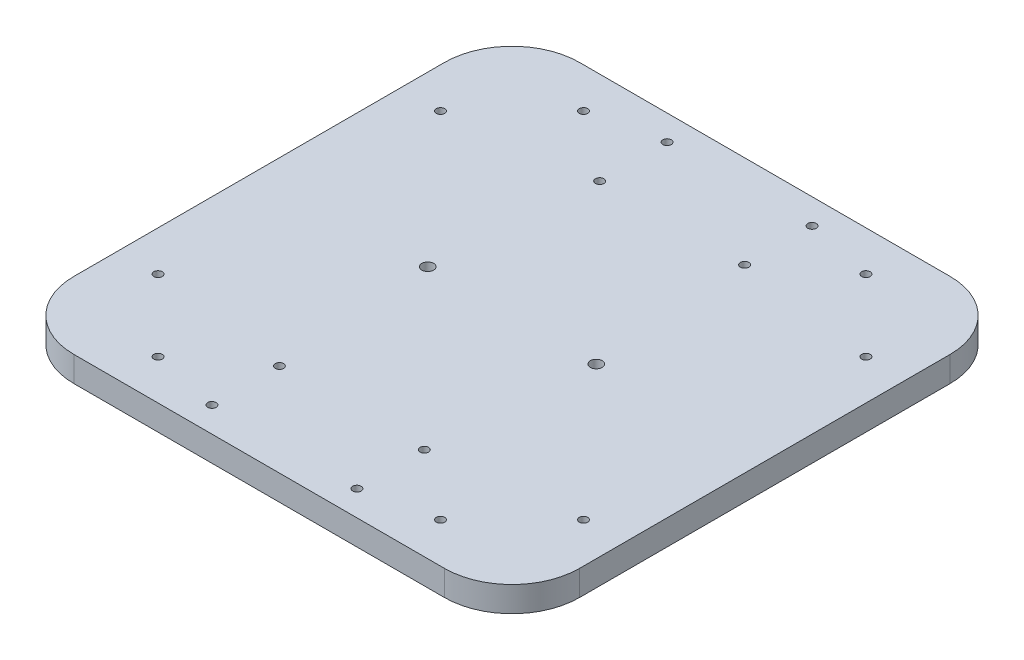
ISO-10303-21;
HEADER;
FILE_DESCRIPTION(('STEP AP214'),'2;1');
FILE_NAME('part.step','',(''),(''),'','','');
FILE_SCHEMA(('AUTOMOTIVE_DESIGN { 1 0 10303 214 1 1 1 1 }'));
ENDSEC;
DATA;
#1=APPLICATION_CONTEXT('core data for automotive mechanical design processes');
#2=APPLICATION_PROTOCOL_DEFINITION('international standard','automotive_design',2000,#1);
#3=PRODUCT_CONTEXT('',#1,'mechanical');
#4=PRODUCT('Part','Part','',(#3));
#5=PRODUCT_RELATED_PRODUCT_CATEGORY('part','',(#4));
#6=PRODUCT_DEFINITION_FORMATION('','',#4);
#7=PRODUCT_DEFINITION_CONTEXT('part definition',#1,'design');
#8=PRODUCT_DEFINITION('design','',#6,#7);
#9=PRODUCT_DEFINITION_SHAPE('','',#8);
#10=(LENGTH_UNIT() NAMED_UNIT(*) SI_UNIT(.MILLI.,.METRE.));
#11=(NAMED_UNIT(*) PLANE_ANGLE_UNIT() SI_UNIT($,.RADIAN.));
#12=(NAMED_UNIT(*) SI_UNIT($,.STERADIAN.) SOLID_ANGLE_UNIT());
#13=UNCERTAINTY_MEASURE_WITH_UNIT(LENGTH_MEASURE(1.E-05),#10,'distance_accuracy_value','');
#14=(GEOMETRIC_REPRESENTATION_CONTEXT(3) GLOBAL_UNCERTAINTY_ASSIGNED_CONTEXT((#13)) GLOBAL_UNIT_ASSIGNED_CONTEXT((#10,
#11,#12)) REPRESENTATION_CONTEXT('',''));
#15=CARTESIAN_POINT('',(0.,0.,0.));
#16=DIRECTION('',(0.,0.,1.));
#17=DIRECTION('',(1.,0.,0.));
#18=AXIS2_PLACEMENT_3D('',#15,#16,#17);
#19=CARTESIAN_POINT('',(150.,-7.5,150.));
#20=DIRECTION('',(-1.,0.,0.));
#21=DIRECTION('',(0.,0.,1.));
#22=AXIS2_PLACEMENT_3D('',#19,#20,#21);
#23=PLANE('',#22);
#24=DIRECTION('',(0.,0.,-1.));
#25=VECTOR('',#24,1.);
#26=CARTESIAN_POINT('',(150.,-7.5,150.));
#27=LINE('',#26,#25);
#28=CARTESIAN_POINT('',(150.,-7.5,110.));
#29=VERTEX_POINT('',#28);
#30=CARTESIAN_POINT('',(150.,-7.5,-110.));
#31=VERTEX_POINT('',#30);
#32=EDGE_CURVE('E124',#29,#31,#27,.T.);
#33=ORIENTED_EDGE('',*,*,#32,.T.);
#34=DIRECTION('',(0.,1.,0.));
#35=VECTOR('',#34,1.);
#36=CARTESIAN_POINT('',(150.,7.5,-110.));
#37=LINE('',#36,#35);
#38=CARTESIAN_POINT('',(150.,7.5,-110.));
#39=VERTEX_POINT('',#38);
#40=EDGE_CURVE('E152',#31,#39,#37,.T.);
#41=ORIENTED_EDGE('',*,*,#40,.T.);
#42=DIRECTION('',(0.,0.,-1.));
#43=VECTOR('',#42,1.);
#44=CARTESIAN_POINT('',(150.,7.5,150.));
#45=LINE('',#44,#43);
#46=CARTESIAN_POINT('',(150.,7.5,110.));
#47=VERTEX_POINT('',#46);
#48=EDGE_CURVE('E128',#47,#39,#45,.T.);
#49=ORIENTED_EDGE('',*,*,#48,.F.);
#50=DIRECTION('',(0.,1.,0.));
#51=VECTOR('',#50,1.);
#52=CARTESIAN_POINT('',(150.,-7.5,110.));
#53=LINE('',#52,#51);
#54=EDGE_CURVE('E150',#47,#29,#53,.F.);
#55=ORIENTED_EDGE('',*,*,#54,.T.);
#56=EDGE_LOOP('',(#33,#41,#49,#55));
#57=FACE_BOUND('',#56,.T.);
#58=ADVANCED_FACE('F36',(#57),#23,.F.);
#59=CARTESIAN_POINT('',(-150.,7.5,150.));
#60=DIRECTION('',(0.,-1.,0.));
#61=DIRECTION('',(0.,0.,-1.));
#62=AXIS2_PLACEMENT_3D('',#59,#60,#61);
#63=PLANE('',#62);
#64=CARTESIAN_POINT('',(43.,7.5,-95.));
#65=DIRECTION('',(0.,-1.,0.));
#66=DIRECTION('',(0.,0.,-1.));
#67=AXIS2_PLACEMENT_3D('',#64,#65,#66);
#68=CIRCLE('',#67,2.5);
#69=CARTESIAN_POINT('',(43.,7.5,-97.5));
#70=VERTEX_POINT('',#69);
#71=EDGE_CURVE('E253',#70,#70,#68,.T.);
#72=ORIENTED_EDGE('',*,*,#71,.T.);
#73=EDGE_LOOP('',(#72));
#74=FACE_BOUND('',#73,.T.);
#75=CARTESIAN_POINT('',(-43.,7.5,95.));
#76=DIRECTION('',(0.,-1.,0.));
#77=DIRECTION('',(0.,0.,-1.));
#78=AXIS2_PLACEMENT_3D('',#75,#76,#77);
#79=CIRCLE('',#78,2.5);
#80=CARTESIAN_POINT('',(-43.,7.5,92.5));
#81=VERTEX_POINT('',#80);
#82=EDGE_CURVE('E242',#81,#81,#79,.T.);
#83=ORIENTED_EDGE('',*,*,#82,.T.);
#84=EDGE_LOOP('',(#83));
#85=FACE_BOUND('',#84,.T.);
#86=CARTESIAN_POINT('',(43.,7.5,95.));
#87=DIRECTION('',(0.,-1.,0.));
#88=DIRECTION('',(0.,0.,-1.));
#89=AXIS2_PLACEMENT_3D('',#86,#87,#88);
#90=CIRCLE('',#89,2.5);
#91=CARTESIAN_POINT('',(43.,7.5,92.5));
#92=VERTEX_POINT('',#91);
#93=EDGE_CURVE('E241',#92,#92,#90,.T.);
#94=ORIENTED_EDGE('',*,*,#93,.T.);
#95=EDGE_LOOP('',(#94));
#96=FACE_BOUND('',#95,.T.);
#97=CARTESIAN_POINT('',(43.,7.5,135.));
#98=DIRECTION('',(0.,-1.,0.));
#99=DIRECTION('',(0.,0.,-1.));
#100=AXIS2_PLACEMENT_3D('',#97,#98,#99);
#101=CIRCLE('',#100,2.5);
#102=CARTESIAN_POINT('',(43.,7.5,132.5));
#103=VERTEX_POINT('',#102);
#104=EDGE_CURVE('E235',#103,#103,#101,.T.);
#105=ORIENTED_EDGE('',*,*,#104,.T.);
#106=EDGE_LOOP('',(#105));
#107=FACE_BOUND('',#106,.T.);
#108=CARTESIAN_POINT('',(43.,7.5,-135.));
#109=DIRECTION('',(0.,-1.,0.));
#110=DIRECTION('',(0.,0.,-1.));
#111=AXIS2_PLACEMENT_3D('',#108,#109,#110);
#112=CIRCLE('',#111,2.5);
#113=CARTESIAN_POINT('',(43.,7.5,-137.5));
#114=VERTEX_POINT('',#113);
#115=EDGE_CURVE('E254',#114,#114,#112,.T.);
#116=ORIENTED_EDGE('',*,*,#115,.T.);
#117=EDGE_LOOP('',(#116));
#118=FACE_BOUND('',#117,.T.);
#119=CARTESIAN_POINT('',(-43.,7.5,-135.));
#120=DIRECTION('',(0.,-1.,0.));
#121=DIRECTION('',(0.,0.,-1.));
#122=AXIS2_PLACEMENT_3D('',#119,#120,#121);
#123=CIRCLE('',#122,2.5);
#124=CARTESIAN_POINT('',(-43.,7.5,-137.5));
#125=VERTEX_POINT('',#124);
#126=EDGE_CURVE('E271',#125,#125,#123,.T.);
#127=ORIENTED_EDGE('',*,*,#126,.T.);
#128=EDGE_LOOP('',(#127));
#129=FACE_BOUND('',#128,.T.);
#130=CARTESIAN_POINT('',(-43.,7.5,-95.));
#131=DIRECTION('',(0.,-1.,0.));
#132=DIRECTION('',(0.,0.,-1.));
#133=AXIS2_PLACEMENT_3D('',#130,#131,#132);
#134=CIRCLE('',#133,2.5);
#135=CARTESIAN_POINT('',(-43.,7.5,-97.5));
#136=VERTEX_POINT('',#135);
#137=EDGE_CURVE('E265',#136,#136,#134,.T.);
#138=ORIENTED_EDGE('',*,*,#137,.T.);
#139=EDGE_LOOP('',(#138));
#140=FACE_BOUND('',#139,.T.);
#141=CARTESIAN_POINT('',(-43.,7.5,135.));
#142=DIRECTION('',(0.,-1.,0.));
#143=DIRECTION('',(0.,0.,-1.));
#144=AXIS2_PLACEMENT_3D('',#141,#142,#143);
#145=CIRCLE('',#144,2.5);
#146=CARTESIAN_POINT('',(-43.,7.5,132.5));
#147=VERTEX_POINT('',#146);
#148=EDGE_CURVE('E218',#147,#147,#145,.T.);
#149=ORIENTED_EDGE('',*,*,#148,.T.);
#150=EDGE_LOOP('',(#149));
#151=FACE_BOUND('',#150,.T.);
#152=CARTESIAN_POINT('',(-83.7867965644036,7.5,126.213203435596));
#153=DIRECTION('',(0.,-1.,0.));
#154=DIRECTION('',(0.,0.,-1.));
#155=AXIS2_PLACEMENT_3D('',#152,#153,#154);
#156=CIRCLE('',#155,2.5);
#157=CARTESIAN_POINT('',(-83.7867965644036,7.5,123.713203435596));
#158=VERTEX_POINT('',#157);
#159=EDGE_CURVE('E187',#158,#158,#156,.T.);
#160=ORIENTED_EDGE('',*,*,#159,.T.);
#161=EDGE_LOOP('',(#160));
#162=FACE_BOUND('',#161,.T.);
#163=CARTESIAN_POINT('',(83.7867965644035,7.5,126.213203435596));
#164=DIRECTION('',(0.,-1.,0.));
#165=DIRECTION('',(0.,0.,-1.));
#166=AXIS2_PLACEMENT_3D('',#163,#164,#165);
#167=CIRCLE('',#166,2.49999999999998);
#168=CARTESIAN_POINT('',(83.7867965644035,7.5,123.713203435596));
#169=VERTEX_POINT('',#168);
#170=EDGE_CURVE('E206',#169,#169,#167,.T.);
#171=ORIENTED_EDGE('',*,*,#170,.T.);
#172=EDGE_LOOP('',(#171));
#173=FACE_BOUND('',#172,.T.);
#174=CARTESIAN_POINT('',(126.213203435596,7.5,83.7867965644036));
#175=DIRECTION('',(0.,-1.,0.));
#176=DIRECTION('',(0.,0.,-1.));
#177=AXIS2_PLACEMENT_3D('',#174,#175,#176);
#178=CIRCLE('',#177,2.5);
#179=CARTESIAN_POINT('',(126.213203435596,7.5,81.2867965644036));
#180=VERTEX_POINT('',#179);
#181=EDGE_CURVE('E200',#180,#180,#178,.T.);
#182=ORIENTED_EDGE('',*,*,#181,.T.);
#183=EDGE_LOOP('',(#182));
#184=FACE_BOUND('',#183,.T.);
#185=CARTESIAN_POINT('',(126.213203435596,7.5,-83.7867965644035));
#186=DIRECTION('',(0.,-1.,0.));
#187=DIRECTION('',(0.,0.,-1.));
#188=AXIS2_PLACEMENT_3D('',#185,#186,#187);
#189=CIRCLE('',#188,2.5);
#190=CARTESIAN_POINT('',(126.213203435596,7.5,-86.2867965644035));
#191=VERTEX_POINT('',#190);
#192=EDGE_CURVE('E193',#191,#191,#189,.T.);
#193=ORIENTED_EDGE('',*,*,#192,.T.);
#194=EDGE_LOOP('',(#193));
#195=FACE_BOUND('',#194,.T.);
#196=CARTESIAN_POINT('',(83.7867965644036,7.5,-126.213203435596));
#197=DIRECTION('',(0.,-1.,0.));
#198=DIRECTION('',(0.,0.,-1.));
#199=AXIS2_PLACEMENT_3D('',#196,#197,#198);
#200=CIRCLE('',#199,2.5);
#201=CARTESIAN_POINT('',(83.7867965644036,7.5,-128.713203435596));
#202=VERTEX_POINT('',#201);
#203=EDGE_CURVE('E194',#202,#202,#200,.T.);
#204=ORIENTED_EDGE('',*,*,#203,.T.);
#205=EDGE_LOOP('',(#204));
#206=FACE_BOUND('',#205,.T.);
#207=CARTESIAN_POINT('',(-83.7867965644035,7.5,-126.213203435596));
#208=DIRECTION('',(0.,-1.,0.));
#209=DIRECTION('',(0.,0.,-1.));
#210=AXIS2_PLACEMENT_3D('',#207,#208,#209);
#211=CIRCLE('',#210,2.5);
#212=CARTESIAN_POINT('',(-83.7867965644035,7.5,-128.713203435596));
#213=VERTEX_POINT('',#212);
#214=EDGE_CURVE('E224',#213,#213,#211,.T.);
#215=ORIENTED_EDGE('',*,*,#214,.T.);
#216=EDGE_LOOP('',(#215));
#217=FACE_BOUND('',#216,.T.);
#218=CARTESIAN_POINT('',(-126.213203435596,7.5,-83.7867965644036));
#219=DIRECTION('',(0.,-1.,0.));
#220=DIRECTION('',(0.,0.,-1.));
#221=AXIS2_PLACEMENT_3D('',#218,#219,#220);
#222=CIRCLE('',#221,2.49999999999998);
#223=CARTESIAN_POINT('',(-126.213203435596,7.5,-86.2867965644036));
#224=VERTEX_POINT('',#223);
#225=EDGE_CURVE('E217',#224,#224,#222,.T.);
#226=ORIENTED_EDGE('',*,*,#225,.T.);
#227=EDGE_LOOP('',(#226));
#228=FACE_BOUND('',#227,.T.);
#229=CARTESIAN_POINT('',(-126.213203435596,7.5,83.7867965644035));
#230=DIRECTION('',(0.,-1.,0.));
#231=DIRECTION('',(0.,0.,-1.));
#232=AXIS2_PLACEMENT_3D('',#229,#230,#231);
#233=CIRCLE('',#232,2.5);
#234=CARTESIAN_POINT('',(-126.213203435596,7.5,81.2867965644035));
#235=VERTEX_POINT('',#234);
#236=EDGE_CURVE('E182',#235,#235,#233,.T.);
#237=ORIENTED_EDGE('',*,*,#236,.T.);
#238=EDGE_LOOP('',(#237));
#239=FACE_BOUND('',#238,.T.);
#240=CARTESIAN_POINT('',(50.,7.5,0.));
#241=DIRECTION('',(0.,-1.,0.));
#242=DIRECTION('',(0.,0.,-1.));
#243=AXIS2_PLACEMENT_3D('',#240,#241,#242);
#244=CIRCLE('',#243,3.5);
#245=CARTESIAN_POINT('',(50.,7.5,-3.5));
#246=VERTEX_POINT('',#245);
#247=EDGE_CURVE('E174',#246,#246,#244,.T.);
#248=ORIENTED_EDGE('',*,*,#247,.T.);
#249=EDGE_LOOP('',(#248));
#250=FACE_BOUND('',#249,.T.);
#251=CARTESIAN_POINT('',(-50.,7.5,0.));
#252=DIRECTION('',(0.,-1.,0.));
#253=DIRECTION('',(0.,0.,-1.));
#254=AXIS2_PLACEMENT_3D('',#251,#252,#253);
#255=CIRCLE('',#254,3.5);
#256=CARTESIAN_POINT('',(-50.,7.5,-3.5));
#257=VERTEX_POINT('',#256);
#258=EDGE_CURVE('E165',#257,#257,#255,.T.);
#259=ORIENTED_EDGE('',*,*,#258,.T.);
#260=EDGE_LOOP('',(#259));
#261=FACE_BOUND('',#260,.T.);
#262=DIRECTION('',(-1.,0.,0.));
#263=VECTOR('',#262,1.);
#264=CARTESIAN_POINT('',(-150.,7.5,-150.));
#265=LINE('',#264,#263);
#266=CARTESIAN_POINT('',(110.,7.5,-150.));
#267=VERTEX_POINT('',#266);
#268=CARTESIAN_POINT('',(-110.,7.5,-150.));
#269=VERTEX_POINT('',#268);
#270=EDGE_CURVE('E162',#267,#269,#265,.T.);
#271=ORIENTED_EDGE('',*,*,#270,.T.);
#272=CARTESIAN_POINT('',(-110.,7.5,-110.));
#273=DIRECTION('',(0.,-1.,0.));
#274=DIRECTION('',(0.,0.,-1.));
#275=AXIS2_PLACEMENT_3D('',#272,#273,#274);
#276=CIRCLE('',#275,40.);
#277=CARTESIAN_POINT('',(-150.,7.5,-110.));
#278=VERTEX_POINT('',#277);
#279=EDGE_CURVE('E148',#269,#278,#276,.F.);
#280=ORIENTED_EDGE('',*,*,#279,.T.);
#281=DIRECTION('',(0.,0.,-1.));
#282=VECTOR('',#281,1.);
#283=CARTESIAN_POINT('',(-150.,7.5,150.));
#284=LINE('',#283,#282);
#285=CARTESIAN_POINT('',(-150.,7.5,110.));
#286=VERTEX_POINT('',#285);
#287=EDGE_CURVE('E123',#286,#278,#284,.T.);
#288=ORIENTED_EDGE('',*,*,#287,.F.);
#289=CARTESIAN_POINT('',(-110.,7.5,110.));
#290=DIRECTION('',(0.,-1.,0.));
#291=DIRECTION('',(0.,0.,-1.));
#292=AXIS2_PLACEMENT_3D('',#289,#290,#291);
#293=CIRCLE('',#292,40.);
#294=CARTESIAN_POINT('',(-110.,7.5,150.));
#295=VERTEX_POINT('',#294);
#296=EDGE_CURVE('E127',#286,#295,#293,.F.);
#297=ORIENTED_EDGE('',*,*,#296,.T.);
#298=DIRECTION('',(-1.,0.,0.));
#299=VECTOR('',#298,1.);
#300=CARTESIAN_POINT('',(-150.,7.5,150.));
#301=LINE('',#300,#299);
#302=CARTESIAN_POINT('',(110.,7.5,150.));
#303=VERTEX_POINT('',#302);
#304=EDGE_CURVE('E157',#303,#295,#301,.T.);
#305=ORIENTED_EDGE('',*,*,#304,.F.);
#306=CARTESIAN_POINT('',(110.,7.5,110.));
#307=DIRECTION('',(0.,-1.,0.));
#308=DIRECTION('',(0.,0.,-1.));
#309=AXIS2_PLACEMENT_3D('',#306,#307,#308);
#310=CIRCLE('',#309,40.);
#311=EDGE_CURVE('E59',#303,#47,#310,.F.);
#312=ORIENTED_EDGE('',*,*,#311,.T.);
#313=ORIENTED_EDGE('',*,*,#48,.T.);
#314=CARTESIAN_POINT('',(110.,7.5,-110.));
#315=DIRECTION('',(0.,-1.,0.));
#316=DIRECTION('',(0.,0.,-1.));
#317=AXIS2_PLACEMENT_3D('',#314,#315,#316);
#318=CIRCLE('',#317,40.);
#319=EDGE_CURVE('E51',#39,#267,#318,.F.);
#320=ORIENTED_EDGE('',*,*,#319,.T.);
#321=EDGE_LOOP('',(#271,#280,#288,#297,#305,#312,#313,#320));
#322=FACE_BOUND('',#321,.T.);
#323=ADVANCED_FACE('F280',(#74,#85,#96,#107,#118,#129,#140,#151,#162,#173,#184,#195,#206,#217,
#228,#239,#250,#261,#322),#63,.F.);
#324=CARTESIAN_POINT('',(-150.,-7.5,150.));
#325=DIRECTION('',(1.,0.,0.));
#326=DIRECTION('',(0.,0.,-1.));
#327=AXIS2_PLACEMENT_3D('',#324,#325,#326);
#328=PLANE('',#327);
#329=ORIENTED_EDGE('',*,*,#287,.T.);
#330=DIRECTION('',(0.,-1.,0.));
#331=VECTOR('',#330,1.);
#332=CARTESIAN_POINT('',(-150.,-7.5,-110.));
#333=LINE('',#332,#331);
#334=CARTESIAN_POINT('',(-150.,-7.5,-110.));
#335=VERTEX_POINT('',#334);
#336=EDGE_CURVE('E114',#278,#335,#333,.T.);
#337=ORIENTED_EDGE('',*,*,#336,.T.);
#338=DIRECTION('',(0.,0.,-1.));
#339=VECTOR('',#338,1.);
#340=CARTESIAN_POINT('',(-150.,-7.5,150.));
#341=LINE('',#340,#339);
#342=CARTESIAN_POINT('',(-150.,-7.5,110.));
#343=VERTEX_POINT('',#342);
#344=EDGE_CURVE('E106',#343,#335,#341,.T.);
#345=ORIENTED_EDGE('',*,*,#344,.F.);
#346=DIRECTION('',(0.,-1.,0.));
#347=VECTOR('',#346,1.);
#348=CARTESIAN_POINT('',(-150.,-7.5,110.));
#349=LINE('',#348,#347);
#350=EDGE_CURVE('E120',#343,#286,#349,.F.);
#351=ORIENTED_EDGE('',*,*,#350,.T.);
#352=EDGE_LOOP('',(#329,#337,#345,#351));
#353=FACE_BOUND('',#352,.T.);
#354=ADVANCED_FACE('F119',(#353),#328,.F.);
#355=CARTESIAN_POINT('',(-150.,-7.5,150.));
#356=DIRECTION('',(0.,1.,0.));
#357=DIRECTION('',(0.,0.,1.));
#358=AXIS2_PLACEMENT_3D('',#355,#356,#357);
#359=PLANE('',#358);
#360=CARTESIAN_POINT('',(43.,-7.5,-95.));
#361=DIRECTION('',(0.,-1.,0.));
#362=DIRECTION('',(0.,0.,-1.));
#363=AXIS2_PLACEMENT_3D('',#360,#361,#362);
#364=CIRCLE('',#363,2.5);
#365=CARTESIAN_POINT('',(43.,-7.5,-97.5));
#366=VERTEX_POINT('',#365);
#367=EDGE_CURVE('E250',#366,#366,#364,.T.);
#368=ORIENTED_EDGE('',*,*,#367,.F.);
#369=EDGE_LOOP('',(#368));
#370=FACE_BOUND('',#369,.T.);
#371=CARTESIAN_POINT('',(-43.,-7.5,95.));
#372=DIRECTION('',(0.,-1.,0.));
#373=DIRECTION('',(0.,0.,-1.));
#374=AXIS2_PLACEMENT_3D('',#371,#372,#373);
#375=CIRCLE('',#374,2.5);
#376=CARTESIAN_POINT('',(-43.,-7.5,92.5));
#377=VERTEX_POINT('',#376);
#378=EDGE_CURVE('E257',#377,#377,#375,.T.);
#379=ORIENTED_EDGE('',*,*,#378,.F.);
#380=EDGE_LOOP('',(#379));
#381=FACE_BOUND('',#380,.T.);
#382=CARTESIAN_POINT('',(43.,-7.5,95.));
#383=DIRECTION('',(0.,-1.,0.));
#384=DIRECTION('',(0.,0.,-1.));
#385=AXIS2_PLACEMENT_3D('',#382,#383,#384);
#386=CIRCLE('',#385,2.5);
#387=CARTESIAN_POINT('',(43.,-7.5,92.5));
#388=VERTEX_POINT('',#387);
#389=EDGE_CURVE('E238',#388,#388,#386,.T.);
#390=ORIENTED_EDGE('',*,*,#389,.F.);
#391=EDGE_LOOP('',(#390));
#392=FACE_BOUND('',#391,.T.);
#393=CARTESIAN_POINT('',(43.,-7.5,135.));
#394=DIRECTION('',(0.,-1.,0.));
#395=DIRECTION('',(0.,0.,-1.));
#396=AXIS2_PLACEMENT_3D('',#393,#394,#395);
#397=CIRCLE('',#396,2.5);
#398=CARTESIAN_POINT('',(43.,-7.5,132.5));
#399=VERTEX_POINT('',#398);
#400=EDGE_CURVE('E245',#399,#399,#397,.T.);
#401=ORIENTED_EDGE('',*,*,#400,.F.);
#402=EDGE_LOOP('',(#401));
#403=FACE_BOUND('',#402,.T.);
#404=CARTESIAN_POINT('',(43.,-7.5,-135.));
#405=DIRECTION('',(0.,-1.,0.));
#406=DIRECTION('',(0.,0.,-1.));
#407=AXIS2_PLACEMENT_3D('',#404,#405,#406);
#408=CIRCLE('',#407,2.5);
#409=CARTESIAN_POINT('',(43.,-7.5,-137.5));
#410=VERTEX_POINT('',#409);
#411=EDGE_CURVE('E274',#410,#410,#408,.T.);
#412=ORIENTED_EDGE('',*,*,#411,.F.);
#413=EDGE_LOOP('',(#412));
#414=FACE_BOUND('',#413,.T.);
#415=CARTESIAN_POINT('',(-43.,-7.5,-135.));
#416=DIRECTION('',(0.,-1.,0.));
#417=DIRECTION('',(0.,0.,-1.));
#418=AXIS2_PLACEMENT_3D('',#415,#416,#417);
#419=CIRCLE('',#418,2.5);
#420=CARTESIAN_POINT('',(-43.,-7.5,-137.5));
#421=VERTEX_POINT('',#420);
#422=EDGE_CURVE('E268',#421,#421,#419,.T.);
#423=ORIENTED_EDGE('',*,*,#422,.F.);
#424=EDGE_LOOP('',(#423));
#425=FACE_BOUND('',#424,.T.);
#426=CARTESIAN_POINT('',(-43.,-7.5,-95.));
#427=DIRECTION('',(0.,-1.,0.));
#428=DIRECTION('',(0.,0.,-1.));
#429=AXIS2_PLACEMENT_3D('',#426,#427,#428);
#430=CIRCLE('',#429,2.5);
#431=CARTESIAN_POINT('',(-43.,-7.5,-97.5));
#432=VERTEX_POINT('',#431);
#433=EDGE_CURVE('E262',#432,#432,#430,.T.);
#434=ORIENTED_EDGE('',*,*,#433,.F.);
#435=EDGE_LOOP('',(#434));
#436=FACE_BOUND('',#435,.T.);
#437=CARTESIAN_POINT('',(-43.,-7.5,135.));
#438=DIRECTION('',(0.,-1.,0.));
#439=DIRECTION('',(0.,0.,-1.));
#440=AXIS2_PLACEMENT_3D('',#437,#438,#439);
#441=CIRCLE('',#440,2.5);
#442=CARTESIAN_POINT('',(-43.,-7.5,132.5));
#443=VERTEX_POINT('',#442);
#444=EDGE_CURVE('E232',#443,#443,#441,.T.);
#445=ORIENTED_EDGE('',*,*,#444,.F.);
#446=EDGE_LOOP('',(#445));
#447=FACE_BOUND('',#446,.T.);
#448=CARTESIAN_POINT('',(-83.7867965644036,-7.5,126.213203435596));
#449=DIRECTION('',(0.,-1.,0.));
#450=DIRECTION('',(0.,0.,-1.));
#451=AXIS2_PLACEMENT_3D('',#448,#449,#450);
#452=CIRCLE('',#451,2.5);
#453=CARTESIAN_POINT('',(-83.7867965644036,-7.5,123.713203435596));
#454=VERTEX_POINT('',#453);
#455=EDGE_CURVE('E209',#454,#454,#452,.T.);
#456=ORIENTED_EDGE('',*,*,#455,.F.);
#457=EDGE_LOOP('',(#456));
#458=FACE_BOUND('',#457,.T.);
#459=CARTESIAN_POINT('',(83.7867965644035,-7.5,126.213203435596));
#460=DIRECTION('',(0.,-1.,0.));
#461=DIRECTION('',(0.,0.,-1.));
#462=AXIS2_PLACEMENT_3D('',#459,#460,#461);
#463=CIRCLE('',#462,2.49999999999998);
#464=CARTESIAN_POINT('',(83.7867965644035,-7.5,123.713203435596));
#465=VERTEX_POINT('',#464);
#466=EDGE_CURVE('E203',#465,#465,#463,.T.);
#467=ORIENTED_EDGE('',*,*,#466,.F.);
#468=EDGE_LOOP('',(#467));
#469=FACE_BOUND('',#468,.T.);
#470=CARTESIAN_POINT('',(126.213203435596,-7.5,83.7867965644036));
#471=DIRECTION('',(0.,-1.,0.));
#472=DIRECTION('',(0.,0.,-1.));
#473=AXIS2_PLACEMENT_3D('',#470,#471,#472);
#474=CIRCLE('',#473,2.5);
#475=CARTESIAN_POINT('',(126.213203435596,-7.5,81.2867965644036));
#476=VERTEX_POINT('',#475);
#477=EDGE_CURVE('E197',#476,#476,#474,.T.);
#478=ORIENTED_EDGE('',*,*,#477,.F.);
#479=EDGE_LOOP('',(#478));
#480=FACE_BOUND('',#479,.T.);
#481=CARTESIAN_POINT('',(126.213203435596,-7.5,-83.7867965644035));
#482=DIRECTION('',(0.,-1.,0.));
#483=DIRECTION('',(0.,0.,-1.));
#484=AXIS2_PLACEMENT_3D('',#481,#482,#483);
#485=CIRCLE('',#484,2.5);
#486=CARTESIAN_POINT('',(126.213203435596,-7.5,-86.2867965644035));
#487=VERTEX_POINT('',#486);
#488=EDGE_CURVE('E190',#487,#487,#485,.T.);
#489=ORIENTED_EDGE('',*,*,#488,.F.);
#490=EDGE_LOOP('',(#489));
#491=FACE_BOUND('',#490,.T.);
#492=CARTESIAN_POINT('',(83.7867965644036,-7.5,-126.213203435596));
#493=DIRECTION('',(0.,-1.,0.));
#494=DIRECTION('',(0.,0.,-1.));
#495=AXIS2_PLACEMENT_3D('',#492,#493,#494);
#496=CIRCLE('',#495,2.5);
#497=CARTESIAN_POINT('',(83.7867965644036,-7.5,-128.713203435596));
#498=VERTEX_POINT('',#497);
#499=EDGE_CURVE('E227',#498,#498,#496,.T.);
#500=ORIENTED_EDGE('',*,*,#499,.F.);
#501=EDGE_LOOP('',(#500));
#502=FACE_BOUND('',#501,.T.);
#503=CARTESIAN_POINT('',(-83.7867965644035,-7.5,-126.213203435596));
#504=DIRECTION('',(0.,-1.,0.));
#505=DIRECTION('',(0.,0.,-1.));
#506=AXIS2_PLACEMENT_3D('',#503,#504,#505);
#507=CIRCLE('',#506,2.5);
#508=CARTESIAN_POINT('',(-83.7867965644035,-7.5,-128.713203435596));
#509=VERTEX_POINT('',#508);
#510=EDGE_CURVE('E221',#509,#509,#507,.T.);
#511=ORIENTED_EDGE('',*,*,#510,.F.);
#512=EDGE_LOOP('',(#511));
#513=FACE_BOUND('',#512,.T.);
#514=CARTESIAN_POINT('',(-126.213203435596,-7.5,-83.7867965644036));
#515=DIRECTION('',(0.,-1.,0.));
#516=DIRECTION('',(0.,0.,-1.));
#517=AXIS2_PLACEMENT_3D('',#514,#515,#516);
#518=CIRCLE('',#517,2.49999999999998);
#519=CARTESIAN_POINT('',(-126.213203435596,-7.5,-86.2867965644036));
#520=VERTEX_POINT('',#519);
#521=EDGE_CURVE('E214',#520,#520,#518,.T.);
#522=ORIENTED_EDGE('',*,*,#521,.F.);
#523=EDGE_LOOP('',(#522));
#524=FACE_BOUND('',#523,.T.);
#525=CARTESIAN_POINT('',(-126.213203435596,-7.5,83.7867965644035));
#526=DIRECTION('',(0.,-1.,0.));
#527=DIRECTION('',(0.,0.,-1.));
#528=AXIS2_PLACEMENT_3D('',#525,#526,#527);
#529=CIRCLE('',#528,2.5);
#530=CARTESIAN_POINT('',(-126.213203435596,-7.5,81.2867965644035));
#531=VERTEX_POINT('',#530);
#532=EDGE_CURVE('E184',#531,#531,#529,.T.);
#533=ORIENTED_EDGE('',*,*,#532,.F.);
#534=EDGE_LOOP('',(#533));
#535=FACE_BOUND('',#534,.T.);
#536=CARTESIAN_POINT('',(50.,-7.5,0.));
#537=DIRECTION('',(0.,1.,0.));
#538=DIRECTION('',(0.,0.,1.));
#539=AXIS2_PLACEMENT_3D('',#536,#537,#538);
#540=CIRCLE('',#539,3.5);
#541=CARTESIAN_POINT('',(50.,-7.5,3.5));
#542=VERTEX_POINT('',#541);
#543=EDGE_CURVE('E133',#542,#542,#540,.T.);
#544=ORIENTED_EDGE('',*,*,#543,.T.);
#545=EDGE_LOOP('',(#544));
#546=FACE_BOUND('',#545,.T.);
#547=CARTESIAN_POINT('',(-50.,-7.5,0.));
#548=DIRECTION('',(0.,1.,0.));
#549=DIRECTION('',(0.,0.,1.));
#550=AXIS2_PLACEMENT_3D('',#547,#548,#549);
#551=CIRCLE('',#550,3.5);
#552=CARTESIAN_POINT('',(-50.,-7.5,3.5));
#553=VERTEX_POINT('',#552);
#554=EDGE_CURVE('E172',#553,#553,#551,.T.);
#555=ORIENTED_EDGE('',*,*,#554,.T.);
#556=EDGE_LOOP('',(#555));
#557=FACE_BOUND('',#556,.T.);
#558=ORIENTED_EDGE('',*,*,#344,.T.);
#559=CARTESIAN_POINT('',(-110.,-7.5,-110.));
#560=DIRECTION('',(0.,1.,0.));
#561=DIRECTION('',(0.,0.,1.));
#562=AXIS2_PLACEMENT_3D('',#559,#560,#561);
#563=CIRCLE('',#562,40.);
#564=CARTESIAN_POINT('',(-110.,-7.5,-150.));
#565=VERTEX_POINT('',#564);
#566=EDGE_CURVE('E139',#335,#565,#563,.F.);
#567=ORIENTED_EDGE('',*,*,#566,.T.);
#568=DIRECTION('',(1.,0.,0.));
#569=VECTOR('',#568,1.);
#570=CARTESIAN_POINT('',(-150.,-7.5,-150.));
#571=LINE('',#570,#569);
#572=CARTESIAN_POINT('',(110.,-7.5,-150.));
#573=VERTEX_POINT('',#572);
#574=EDGE_CURVE('E158',#565,#573,#571,.T.);
#575=ORIENTED_EDGE('',*,*,#574,.T.);
#576=CARTESIAN_POINT('',(110.,-7.5,-110.));
#577=DIRECTION('',(0.,1.,0.));
#578=DIRECTION('',(0.,0.,1.));
#579=AXIS2_PLACEMENT_3D('',#576,#577,#578);
#580=CIRCLE('',#579,40.);
#581=EDGE_CURVE('E137',#573,#31,#580,.F.);
#582=ORIENTED_EDGE('',*,*,#581,.T.);
#583=ORIENTED_EDGE('',*,*,#32,.F.);
#584=CARTESIAN_POINT('',(110.,-7.5,110.));
#585=DIRECTION('',(0.,1.,0.));
#586=DIRECTION('',(0.,0.,1.));
#587=AXIS2_PLACEMENT_3D('',#584,#585,#586);
#588=CIRCLE('',#587,40.);
#589=CARTESIAN_POINT('',(110.,-7.5,150.));
#590=VERTEX_POINT('',#589);
#591=EDGE_CURVE('E113',#29,#590,#588,.F.);
#592=ORIENTED_EDGE('',*,*,#591,.T.);
#593=DIRECTION('',(1.,0.,0.));
#594=VECTOR('',#593,1.);
#595=CARTESIAN_POINT('',(-150.,-7.5,150.));
#596=LINE('',#595,#594);
#597=CARTESIAN_POINT('',(-110.,-7.5,150.));
#598=VERTEX_POINT('',#597);
#599=EDGE_CURVE('E108',#598,#590,#596,.T.);
#600=ORIENTED_EDGE('',*,*,#599,.F.);
#601=CARTESIAN_POINT('',(-110.,-7.5,110.));
#602=DIRECTION('',(0.,1.,0.));
#603=DIRECTION('',(0.,0.,1.));
#604=AXIS2_PLACEMENT_3D('',#601,#602,#603);
#605=CIRCLE('',#604,40.);
#606=EDGE_CURVE('E103',#598,#343,#605,.F.);
#607=ORIENTED_EDGE('',*,*,#606,.T.);
#608=EDGE_LOOP('',(#558,#567,#575,#582,#583,#592,#600,#607));
#609=FACE_BOUND('',#608,.T.);
#610=ADVANCED_FACE('F105',(#370,#381,#392,#403,#414,#425,#436,#447,#458,#469,#480,#491,#502,
#513,#524,#535,#546,#557,#609),#359,.F.);
#611=CARTESIAN_POINT('',(0.,0.,150.));
#612=DIRECTION('',(0.,0.,-1.));
#613=DIRECTION('',(-1.,0.,0.));
#614=AXIS2_PLACEMENT_3D('',#611,#612,#613);
#615=PLANE('',#614);
#616=ORIENTED_EDGE('',*,*,#599,.T.);
#617=DIRECTION('',(0.,1.,0.));
#618=VECTOR('',#617,1.);
#619=CARTESIAN_POINT('',(110.,0.,150.));
#620=LINE('',#619,#618);
#621=EDGE_CURVE('E11',#590,#303,#620,.T.);
#622=ORIENTED_EDGE('',*,*,#621,.T.);
#623=ORIENTED_EDGE('',*,*,#304,.T.);
#624=DIRECTION('',(0.,-1.,0.));
#625=VECTOR('',#624,1.);
#626=CARTESIAN_POINT('',(-110.,0.,150.));
#627=LINE('',#626,#625);
#628=EDGE_CURVE('E44',#295,#598,#627,.T.);
#629=ORIENTED_EDGE('',*,*,#628,.T.);
#630=EDGE_LOOP('',(#616,#622,#623,#629));
#631=FACE_BOUND('',#630,.T.);
#632=ADVANCED_FACE('F155',(#631),#615,.F.);
#633=CARTESIAN_POINT('',(0.,0.,-150.));
#634=DIRECTION('',(0.,0.,-1.));
#635=DIRECTION('',(-1.,0.,0.));
#636=AXIS2_PLACEMENT_3D('',#633,#634,#635);
#637=PLANE('',#636);
#638=ORIENTED_EDGE('',*,*,#574,.F.);
#639=DIRECTION('',(0.,-1.,0.));
#640=VECTOR('',#639,1.);
#641=CARTESIAN_POINT('',(-110.,7.5,-150.));
#642=LINE('',#641,#640);
#643=EDGE_CURVE('E143',#565,#269,#642,.F.);
#644=ORIENTED_EDGE('',*,*,#643,.T.);
#645=ORIENTED_EDGE('',*,*,#270,.F.);
#646=DIRECTION('',(0.,1.,0.));
#647=VECTOR('',#646,1.);
#648=CARTESIAN_POINT('',(110.,-7.5,-150.));
#649=LINE('',#648,#647);
#650=EDGE_CURVE('E141',#267,#573,#649,.F.);
#651=ORIENTED_EDGE('',*,*,#650,.T.);
#652=EDGE_LOOP('',(#638,#644,#645,#651));
#653=FACE_BOUND('',#652,.T.);
#654=ADVANCED_FACE('F332',(#653),#637,.T.);
#655=CARTESIAN_POINT('',(-50.,7.5,0.));
#656=DIRECTION('',(0.,-1.,0.));
#657=DIRECTION('',(0.,0.,-1.));
#658=AXIS2_PLACEMENT_3D('',#655,#656,#657);
#659=CYLINDRICAL_SURFACE('',#658,3.5);
#660=ORIENTED_EDGE('',*,*,#258,.F.);
#661=EDGE_LOOP('',(#660));
#662=FACE_BOUND('',#661,.T.);
#663=ORIENTED_EDGE('',*,*,#554,.F.);
#664=EDGE_LOOP('',(#663));
#665=FACE_BOUND('',#664,.T.);
#666=ADVANCED_FACE('F322',(#662,#665),#659,.F.);
#667=CARTESIAN_POINT('',(50.,7.5,0.));
#668=DIRECTION('',(0.,-1.,0.));
#669=DIRECTION('',(0.,0.,-1.));
#670=AXIS2_PLACEMENT_3D('',#667,#668,#669);
#671=CYLINDRICAL_SURFACE('',#670,3.5);
#672=ORIENTED_EDGE('',*,*,#247,.F.);
#673=EDGE_LOOP('',(#672));
#674=FACE_BOUND('',#673,.T.);
#675=ORIENTED_EDGE('',*,*,#543,.F.);
#676=EDGE_LOOP('',(#675));
#677=FACE_BOUND('',#676,.T.);
#678=ADVANCED_FACE('F319',(#674,#677),#671,.F.);
#679=CARTESIAN_POINT('',(-126.213203435596,7.5,83.7867965644035));
#680=DIRECTION('',(0.,-1.,0.));
#681=DIRECTION('',(0.,0.,-1.));
#682=AXIS2_PLACEMENT_3D('',#679,#680,#681);
#683=CYLINDRICAL_SURFACE('',#682,2.5);
#684=ORIENTED_EDGE('',*,*,#236,.F.);
#685=EDGE_LOOP('',(#684));
#686=FACE_BOUND('',#685,.T.);
#687=ORIENTED_EDGE('',*,*,#532,.T.);
#688=EDGE_LOOP('',(#687));
#689=FACE_BOUND('',#688,.T.);
#690=ADVANCED_FACE('F321',(#686,#689),#683,.F.);
#691=CARTESIAN_POINT('',(-126.213203435596,7.5,-83.7867965644036));
#692=DIRECTION('',(0.,-1.,0.));
#693=DIRECTION('',(0.,0.,-1.));
#694=AXIS2_PLACEMENT_3D('',#691,#692,#693);
#695=CYLINDRICAL_SURFACE('',#694,2.49999999999998);
#696=ORIENTED_EDGE('',*,*,#225,.F.);
#697=EDGE_LOOP('',(#696));
#698=FACE_BOUND('',#697,.T.);
#699=ORIENTED_EDGE('',*,*,#521,.T.);
#700=EDGE_LOOP('',(#699));
#701=FACE_BOUND('',#700,.T.);
#702=ADVANCED_FACE('F329',(#698,#701),#695,.F.);
#703=CARTESIAN_POINT('',(-83.7867965644035,7.5,-126.213203435596));
#704=DIRECTION('',(0.,-1.,0.));
#705=DIRECTION('',(0.,0.,-1.));
#706=AXIS2_PLACEMENT_3D('',#703,#704,#705);
#707=CYLINDRICAL_SURFACE('',#706,2.5);
#708=ORIENTED_EDGE('',*,*,#214,.F.);
#709=EDGE_LOOP('',(#708));
#710=FACE_BOUND('',#709,.T.);
#711=ORIENTED_EDGE('',*,*,#510,.T.);
#712=EDGE_LOOP('',(#711));
#713=FACE_BOUND('',#712,.T.);
#714=ADVANCED_FACE('F504',(#710,#713),#707,.F.);
#715=CARTESIAN_POINT('',(83.7867965644036,7.5,-126.213203435596));
#716=DIRECTION('',(0.,-1.,0.));
#717=DIRECTION('',(0.,0.,-1.));
#718=AXIS2_PLACEMENT_3D('',#715,#716,#717);
#719=CYLINDRICAL_SURFACE('',#718,2.5);
#720=ORIENTED_EDGE('',*,*,#203,.F.);
#721=EDGE_LOOP('',(#720));
#722=FACE_BOUND('',#721,.T.);
#723=ORIENTED_EDGE('',*,*,#499,.T.);
#724=EDGE_LOOP('',(#723));
#725=FACE_BOUND('',#724,.T.);
#726=ADVANCED_FACE('F500',(#722,#725),#719,.F.);
#727=CARTESIAN_POINT('',(126.213203435596,7.5,-83.7867965644035));
#728=DIRECTION('',(0.,-1.,0.));
#729=DIRECTION('',(0.,0.,-1.));
#730=AXIS2_PLACEMENT_3D('',#727,#728,#729);
#731=CYLINDRICAL_SURFACE('',#730,2.5);
#732=ORIENTED_EDGE('',*,*,#192,.F.);
#733=EDGE_LOOP('',(#732));
#734=FACE_BOUND('',#733,.T.);
#735=ORIENTED_EDGE('',*,*,#488,.T.);
#736=EDGE_LOOP('',(#735));
#737=FACE_BOUND('',#736,.T.);
#738=ADVANCED_FACE('F503',(#734,#737),#731,.F.);
#739=CARTESIAN_POINT('',(126.213203435596,7.5,83.7867965644036));
#740=DIRECTION('',(0.,-1.,0.));
#741=DIRECTION('',(0.,0.,-1.));
#742=AXIS2_PLACEMENT_3D('',#739,#740,#741);
#743=CYLINDRICAL_SURFACE('',#742,2.5);
#744=ORIENTED_EDGE('',*,*,#181,.F.);
#745=EDGE_LOOP('',(#744));
#746=FACE_BOUND('',#745,.T.);
#747=ORIENTED_EDGE('',*,*,#477,.T.);
#748=EDGE_LOOP('',(#747));
#749=FACE_BOUND('',#748,.T.);
#750=ADVANCED_FACE('F517',(#746,#749),#743,.F.);
#751=CARTESIAN_POINT('',(83.7867965644035,7.5,126.213203435596));
#752=DIRECTION('',(0.,-1.,0.));
#753=DIRECTION('',(0.,0.,-1.));
#754=AXIS2_PLACEMENT_3D('',#751,#752,#753);
#755=CYLINDRICAL_SURFACE('',#754,2.49999999999998);
#756=ORIENTED_EDGE('',*,*,#170,.F.);
#757=EDGE_LOOP('',(#756));
#758=FACE_BOUND('',#757,.T.);
#759=ORIENTED_EDGE('',*,*,#466,.T.);
#760=EDGE_LOOP('',(#759));
#761=FACE_BOUND('',#760,.T.);
#762=ADVANCED_FACE('F513',(#758,#761),#755,.F.);
#763=CARTESIAN_POINT('',(-83.7867965644036,7.5,126.213203435596));
#764=DIRECTION('',(0.,-1.,0.));
#765=DIRECTION('',(0.,0.,-1.));
#766=AXIS2_PLACEMENT_3D('',#763,#764,#765);
#767=CYLINDRICAL_SURFACE('',#766,2.5);
#768=ORIENTED_EDGE('',*,*,#159,.F.);
#769=EDGE_LOOP('',(#768));
#770=FACE_BOUND('',#769,.T.);
#771=ORIENTED_EDGE('',*,*,#455,.T.);
#772=EDGE_LOOP('',(#771));
#773=FACE_BOUND('',#772,.T.);
#774=ADVANCED_FACE('F350',(#770,#773),#767,.F.);
#775=CARTESIAN_POINT('',(-110.,-7.5,-110.));
#776=DIRECTION('',(0.,1.,0.));
#777=DIRECTION('',(0.,0.,1.));
#778=AXIS2_PLACEMENT_3D('',#775,#776,#777);
#779=CYLINDRICAL_SURFACE('',#778,40.);
#780=ORIENTED_EDGE('',*,*,#279,.F.);
#781=ORIENTED_EDGE('',*,*,#643,.F.);
#782=ORIENTED_EDGE('',*,*,#566,.F.);
#783=ORIENTED_EDGE('',*,*,#336,.F.);
#784=EDGE_LOOP('',(#780,#781,#782,#783));
#785=FACE_BOUND('',#784,.T.);
#786=ADVANCED_FACE('F346',(#785),#779,.T.);
#787=CARTESIAN_POINT('',(110.,-7.5,-110.));
#788=DIRECTION('',(0.,-1.,0.));
#789=DIRECTION('',(0.,0.,-1.));
#790=AXIS2_PLACEMENT_3D('',#787,#788,#789);
#791=CYLINDRICAL_SURFACE('',#790,40.);
#792=ORIENTED_EDGE('',*,*,#581,.F.);
#793=ORIENTED_EDGE('',*,*,#650,.F.);
#794=ORIENTED_EDGE('',*,*,#319,.F.);
#795=ORIENTED_EDGE('',*,*,#40,.F.);
#796=EDGE_LOOP('',(#792,#793,#794,#795));
#797=FACE_BOUND('',#796,.T.);
#798=ADVANCED_FACE('F349',(#797),#791,.T.);
#799=CARTESIAN_POINT('',(110.,0.,110.));
#800=DIRECTION('',(0.,1.,0.));
#801=DIRECTION('',(0.,0.,1.));
#802=AXIS2_PLACEMENT_3D('',#799,#800,#801);
#803=CYLINDRICAL_SURFACE('',#802,40.);
#804=ORIENTED_EDGE('',*,*,#591,.F.);
#805=ORIENTED_EDGE('',*,*,#54,.F.);
#806=ORIENTED_EDGE('',*,*,#311,.F.);
#807=ORIENTED_EDGE('',*,*,#621,.F.);
#808=EDGE_LOOP('',(#804,#805,#806,#807));
#809=FACE_BOUND('',#808,.T.);
#810=ADVANCED_FACE('F353',(#809),#803,.T.);
#811=CARTESIAN_POINT('',(-110.,0.,110.));
#812=DIRECTION('',(0.,-1.,0.));
#813=DIRECTION('',(0.,0.,-1.));
#814=AXIS2_PLACEMENT_3D('',#811,#812,#813);
#815=CYLINDRICAL_SURFACE('',#814,40.);
#816=ORIENTED_EDGE('',*,*,#296,.F.);
#817=ORIENTED_EDGE('',*,*,#350,.F.);
#818=ORIENTED_EDGE('',*,*,#606,.F.);
#819=ORIENTED_EDGE('',*,*,#628,.F.);
#820=EDGE_LOOP('',(#816,#817,#818,#819));
#821=FACE_BOUND('',#820,.T.);
#822=ADVANCED_FACE('F38',(#821),#815,.T.);
#823=CARTESIAN_POINT('',(-43.,7.5,135.));
#824=DIRECTION('',(0.,-1.,0.));
#825=DIRECTION('',(0.,0.,-1.));
#826=AXIS2_PLACEMENT_3D('',#823,#824,#825);
#827=CYLINDRICAL_SURFACE('',#826,2.5);
#828=ORIENTED_EDGE('',*,*,#148,.F.);
#829=EDGE_LOOP('',(#828));
#830=FACE_BOUND('',#829,.T.);
#831=ORIENTED_EDGE('',*,*,#444,.T.);
#832=EDGE_LOOP('',(#831));
#833=FACE_BOUND('',#832,.T.);
#834=ADVANCED_FACE('F359',(#830,#833),#827,.F.);
#835=CARTESIAN_POINT('',(-43.,7.5,-95.));
#836=DIRECTION('',(0.,-1.,0.));
#837=DIRECTION('',(0.,0.,-1.));
#838=AXIS2_PLACEMENT_3D('',#835,#836,#837);
#839=CYLINDRICAL_SURFACE('',#838,2.5);
#840=ORIENTED_EDGE('',*,*,#137,.F.);
#841=EDGE_LOOP('',(#840));
#842=FACE_BOUND('',#841,.T.);
#843=ORIENTED_EDGE('',*,*,#433,.T.);
#844=EDGE_LOOP('',(#843));
#845=FACE_BOUND('',#844,.T.);
#846=ADVANCED_FACE('F429',(#842,#845),#839,.F.);
#847=CARTESIAN_POINT('',(-43.,7.5,-135.));
#848=DIRECTION('',(0.,-1.,0.));
#849=DIRECTION('',(0.,0.,-1.));
#850=AXIS2_PLACEMENT_3D('',#847,#848,#849);
#851=CYLINDRICAL_SURFACE('',#850,2.5);
#852=ORIENTED_EDGE('',*,*,#126,.F.);
#853=EDGE_LOOP('',(#852));
#854=FACE_BOUND('',#853,.T.);
#855=ORIENTED_EDGE('',*,*,#422,.T.);
#856=EDGE_LOOP('',(#855));
#857=FACE_BOUND('',#856,.T.);
#858=ADVANCED_FACE('F287',(#854,#857),#851,.F.);
#859=CARTESIAN_POINT('',(43.,7.5,-135.));
#860=DIRECTION('',(0.,-1.,0.));
#861=DIRECTION('',(0.,0.,-1.));
#862=AXIS2_PLACEMENT_3D('',#859,#860,#861);
#863=CYLINDRICAL_SURFACE('',#862,2.5);
#864=ORIENTED_EDGE('',*,*,#115,.F.);
#865=EDGE_LOOP('',(#864));
#866=FACE_BOUND('',#865,.T.);
#867=ORIENTED_EDGE('',*,*,#411,.T.);
#868=EDGE_LOOP('',(#867));
#869=FACE_BOUND('',#868,.T.);
#870=ADVANCED_FACE('F283',(#866,#869),#863,.F.);
#871=CARTESIAN_POINT('',(43.,7.5,135.));
#872=DIRECTION('',(0.,-1.,0.));
#873=DIRECTION('',(0.,0.,-1.));
#874=AXIS2_PLACEMENT_3D('',#871,#872,#873);
#875=CYLINDRICAL_SURFACE('',#874,2.5);
#876=ORIENTED_EDGE('',*,*,#104,.F.);
#877=EDGE_LOOP('',(#876));
#878=FACE_BOUND('',#877,.T.);
#879=ORIENTED_EDGE('',*,*,#400,.T.);
#880=EDGE_LOOP('',(#879));
#881=FACE_BOUND('',#880,.T.);
#882=ADVANCED_FACE('F286',(#878,#881),#875,.F.);
#883=CARTESIAN_POINT('',(43.,7.5,95.));
#884=DIRECTION('',(0.,-1.,0.));
#885=DIRECTION('',(0.,0.,-1.));
#886=AXIS2_PLACEMENT_3D('',#883,#884,#885);
#887=CYLINDRICAL_SURFACE('',#886,2.5);
#888=ORIENTED_EDGE('',*,*,#93,.F.);
#889=EDGE_LOOP('',(#888));
#890=FACE_BOUND('',#889,.T.);
#891=ORIENTED_EDGE('',*,*,#389,.T.);
#892=EDGE_LOOP('',(#891));
#893=FACE_BOUND('',#892,.T.);
#894=ADVANCED_FACE('F454',(#890,#893),#887,.F.);
#895=CARTESIAN_POINT('',(-43.,7.5,95.));
#896=DIRECTION('',(0.,-1.,0.));
#897=DIRECTION('',(0.,0.,-1.));
#898=AXIS2_PLACEMENT_3D('',#895,#896,#897);
#899=CYLINDRICAL_SURFACE('',#898,2.5);
#900=ORIENTED_EDGE('',*,*,#82,.F.);
#901=EDGE_LOOP('',(#900));
#902=FACE_BOUND('',#901,.T.);
#903=ORIENTED_EDGE('',*,*,#378,.T.);
#904=EDGE_LOOP('',(#903));
#905=FACE_BOUND('',#904,.T.);
#906=ADVANCED_FACE('F462',(#902,#905),#899,.F.);
#907=CARTESIAN_POINT('',(43.,7.5,-95.));
#908=DIRECTION('',(0.,-1.,0.));
#909=DIRECTION('',(0.,0.,-1.));
#910=AXIS2_PLACEMENT_3D('',#907,#908,#909);
#911=CYLINDRICAL_SURFACE('',#910,2.5);
#912=ORIENTED_EDGE('',*,*,#71,.F.);
#913=EDGE_LOOP('',(#912));
#914=FACE_BOUND('',#913,.T.);
#915=ORIENTED_EDGE('',*,*,#367,.T.);
#916=EDGE_LOOP('',(#915));
#917=FACE_BOUND('',#916,.T.);
#918=ADVANCED_FACE('F470',(#914,#917),#911,.F.);
#919=CLOSED_SHELL('',(#58,#323,#354,#610,#632,#654,#666,#678,#690,#702,#714,#726,#738,#750,#762,
#774,#786,#798,#810,#822,#834,#846,#858,#870,#882,#894,#906,#918));
#920=MANIFOLD_SOLID_BREP('B2',#919);
#921=ADVANCED_BREP_SHAPE_REPRESENTATION('',(#18,#920),#14);
#922=SHAPE_DEFINITION_REPRESENTATION(#9,#921);
ENDSEC;
END-ISO-10303-21;
